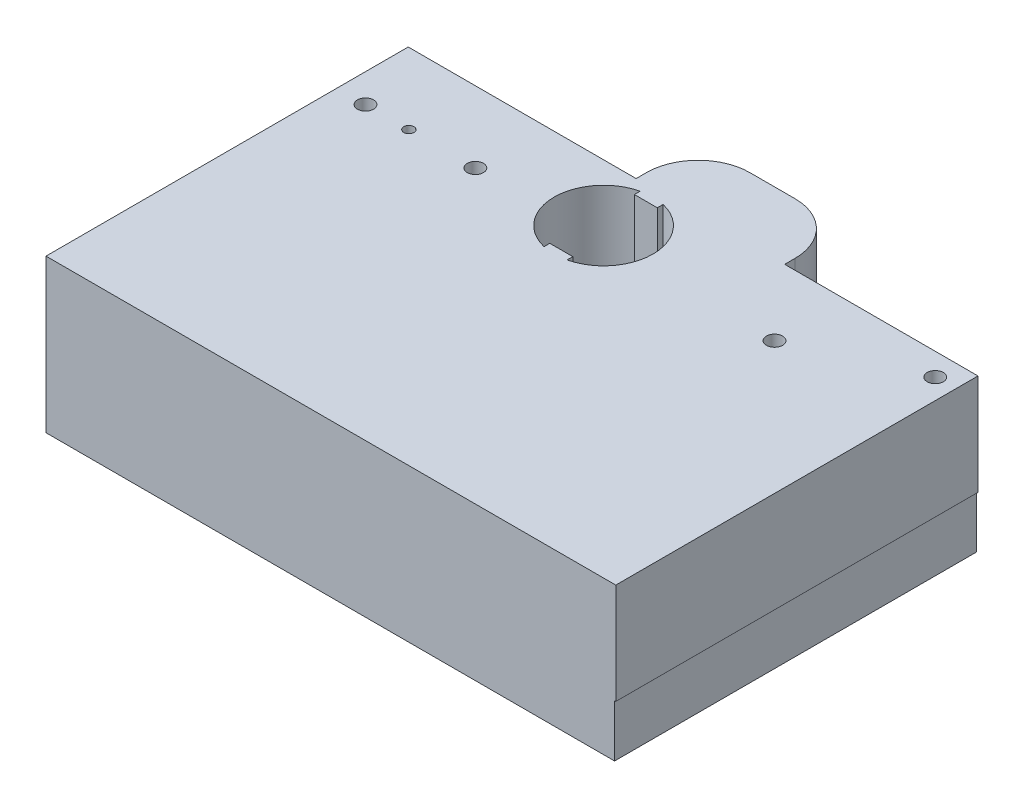
ISO-10303-21;
HEADER;
FILE_DESCRIPTION(('STEP AP214'),'2;1');
FILE_NAME('part.step','',(''),(''),'','','');
FILE_SCHEMA(('AUTOMOTIVE_DESIGN { 1 0 10303 214 1 1 1 1 }'));
ENDSEC;
DATA;
#1=APPLICATION_CONTEXT('core data for automotive mechanical design processes');
#2=APPLICATION_PROTOCOL_DEFINITION('international standard','automotive_design',2000,#1);
#3=PRODUCT_CONTEXT('',#1,'mechanical');
#4=PRODUCT('Part','Part','',(#3));
#5=PRODUCT_RELATED_PRODUCT_CATEGORY('part','',(#4));
#6=PRODUCT_DEFINITION_FORMATION('','',#4);
#7=PRODUCT_DEFINITION_CONTEXT('part definition',#1,'design');
#8=PRODUCT_DEFINITION('design','',#6,#7);
#9=PRODUCT_DEFINITION_SHAPE('','',#8);
#10=(LENGTH_UNIT() NAMED_UNIT(*) SI_UNIT(.MILLI.,.METRE.));
#11=(NAMED_UNIT(*) PLANE_ANGLE_UNIT() SI_UNIT($,.RADIAN.));
#12=(NAMED_UNIT(*) SI_UNIT($,.STERADIAN.) SOLID_ANGLE_UNIT());
#13=UNCERTAINTY_MEASURE_WITH_UNIT(LENGTH_MEASURE(1.E-05),#10,'distance_accuracy_value','');
#14=(GEOMETRIC_REPRESENTATION_CONTEXT(3) GLOBAL_UNCERTAINTY_ASSIGNED_CONTEXT((#13)) GLOBAL_UNIT_ASSIGNED_CONTEXT((#10,
#11,#12)) REPRESENTATION_CONTEXT('',''));
#15=CARTESIAN_POINT('',(0.,0.,0.));
#16=DIRECTION('',(0.,0.,1.));
#17=DIRECTION('',(1.,0.,0.));
#18=AXIS2_PLACEMENT_3D('',#15,#16,#17);
#19=CARTESIAN_POINT('',(0.,75.184,-178.));
#20=DIRECTION('',(0.,0.,1.));
#21=DIRECTION('',(1.,0.,0.));
#22=AXIS2_PLACEMENT_3D('',#19,#20,#21);
#23=PLANE('',#22);
#24=DIRECTION('',(0.,-1.,0.));
#25=VECTOR('',#24,1.);
#26=CARTESIAN_POINT('',(185.000000008,75.184,-178.));
#27=LINE('',#26,#25);
#28=CARTESIAN_POINT('',(185.000000008,75.184,-178.));
#29=VERTEX_POINT('',#28);
#30=CARTESIAN_POINT('',(185.000000008,25.654,-178.));
#31=VERTEX_POINT('',#30);
#32=EDGE_CURVE('E204',#29,#31,#27,.T.);
#33=ORIENTED_EDGE('',*,*,#32,.F.);
#34=DIRECTION('',(-1.,0.,0.));
#35=VECTOR('',#34,1.);
#36=CARTESIAN_POINT('',(0.,75.184,-178.));
#37=LINE('',#36,#35);
#38=CARTESIAN_POINT('',(280.,75.184,-178.));
#39=VERTEX_POINT('',#38);
#40=EDGE_CURVE('E211',#39,#29,#37,.T.);
#41=ORIENTED_EDGE('',*,*,#40,.F.);
#42=DIRECTION('',(0.,-1.,0.));
#43=VECTOR('',#42,1.);
#44=CARTESIAN_POINT('',(280.,75.184,-178.));
#45=LINE('',#44,#43);
#46=CARTESIAN_POINT('',(280.,25.654,-178.));
#47=VERTEX_POINT('',#46);
#48=EDGE_CURVE('E307',#39,#47,#45,.T.);
#49=ORIENTED_EDGE('',*,*,#48,.T.);
#50=DIRECTION('',(-1.,0.,0.));
#51=VECTOR('',#50,1.);
#52=CARTESIAN_POINT('',(0.,25.654,-178.));
#53=LINE('',#52,#51);
#54=EDGE_CURVE('E311',#47,#31,#53,.T.);
#55=ORIENTED_EDGE('',*,*,#54,.T.);
#56=EDGE_LOOP('',(#33,#41,#49,#55));
#57=FACE_BOUND('',#56,.T.);
#58=ADVANCED_FACE('F40',(#57),#23,.F.);
#59=CARTESIAN_POINT('',(0.,25.654,0.));
#60=DIRECTION('',(1.,0.,0.));
#61=DIRECTION('',(0.,0.,-1.));
#62=AXIS2_PLACEMENT_3D('',#59,#60,#61);
#63=PLANE('',#62);
#64=DIRECTION('',(0.,-1.,0.));
#65=VECTOR('',#64,1.);
#66=CARTESIAN_POINT('',(0.,25.654,0.));
#67=LINE('',#66,#65);
#68=CARTESIAN_POINT('',(0.,75.184,0.));
#69=VERTEX_POINT('',#68);
#70=CARTESIAN_POINT('',(0.,0.,0.));
#71=VERTEX_POINT('',#70);
#72=EDGE_CURVE('E274',#69,#71,#67,.T.);
#73=ORIENTED_EDGE('',*,*,#72,.F.);
#74=DIRECTION('',(0.,0.,1.));
#75=VECTOR('',#74,1.);
#76=CARTESIAN_POINT('',(0.,75.184,-108.000000046));
#77=LINE('',#76,#75);
#78=CARTESIAN_POINT('',(0.,75.184,-178.));
#79=VERTEX_POINT('',#78);
#80=EDGE_CURVE('E313',#79,#69,#77,.T.);
#81=ORIENTED_EDGE('',*,*,#80,.F.);
#82=DIRECTION('',(0.,-1.,0.));
#83=VECTOR('',#82,1.);
#84=CARTESIAN_POINT('',(0.,75.184,-178.));
#85=LINE('',#84,#83);
#86=CARTESIAN_POINT('',(0.,25.654,-178.));
#87=VERTEX_POINT('',#86);
#88=EDGE_CURVE('E208',#79,#87,#85,.T.);
#89=ORIENTED_EDGE('',*,*,#88,.T.);
#90=DIRECTION('',(0.,0.,1.));
#91=VECTOR('',#90,1.);
#92=CARTESIAN_POINT('',(0.,25.654,-108.000000046));
#93=LINE('',#92,#91);
#94=CARTESIAN_POINT('',(0.,25.654,-177.8));
#95=VERTEX_POINT('',#94);
#96=EDGE_CURVE('E224',#87,#95,#93,.T.);
#97=ORIENTED_EDGE('',*,*,#96,.T.);
#98=DIRECTION('',(0.,-1.,0.));
#99=VECTOR('',#98,1.);
#100=CARTESIAN_POINT('',(0.,25.654,-177.8));
#101=LINE('',#100,#99);
#102=CARTESIAN_POINT('',(0.,0.,-177.8));
#103=VERTEX_POINT('',#102);
#104=EDGE_CURVE('E288',#95,#103,#101,.T.);
#105=ORIENTED_EDGE('',*,*,#104,.T.);
#106=DIRECTION('',(0.,0.,1.));
#107=VECTOR('',#106,1.);
#108=CARTESIAN_POINT('',(0.,0.,0.));
#109=LINE('',#108,#107);
#110=EDGE_CURVE('E278',#103,#71,#109,.T.);
#111=ORIENTED_EDGE('',*,*,#110,.T.);
#112=EDGE_LOOP('',(#73,#81,#89,#97,#105,#111));
#113=FACE_BOUND('',#112,.T.);
#114=ADVANCED_FACE('F364',(#113),#63,.F.);
#115=CARTESIAN_POINT('',(0.,25.654,0.));
#116=DIRECTION('',(0.,0.,-1.));
#117=DIRECTION('',(-1.,0.,0.));
#118=AXIS2_PLACEMENT_3D('',#115,#116,#117);
#119=PLANE('',#118);
#120=DIRECTION('',(1.,0.,0.));
#121=VECTOR('',#120,1.);
#122=CARTESIAN_POINT('',(0.,0.,0.));
#123=LINE('',#122,#121);
#124=CARTESIAN_POINT('',(279.4,0.,0.));
#125=VERTEX_POINT('',#124);
#126=EDGE_CURVE('E297',#71,#125,#123,.T.);
#127=ORIENTED_EDGE('',*,*,#126,.T.);
#128=DIRECTION('',(0.,-1.,0.));
#129=VECTOR('',#128,1.);
#130=CARTESIAN_POINT('',(279.4,25.654,0.));
#131=LINE('',#130,#129);
#132=CARTESIAN_POINT('',(279.4,25.654,0.));
#133=VERTEX_POINT('',#132);
#134=EDGE_CURVE('E282',#133,#125,#131,.T.);
#135=ORIENTED_EDGE('',*,*,#134,.F.);
#136=DIRECTION('',(1.,0.,0.));
#137=VECTOR('',#136,1.);
#138=CARTESIAN_POINT('',(127.6,25.654,0.));
#139=LINE('',#138,#137);
#140=CARTESIAN_POINT('',(280.,25.654,0.));
#141=VERTEX_POINT('',#140);
#142=EDGE_CURVE('E316',#133,#141,#139,.T.);
#143=ORIENTED_EDGE('',*,*,#142,.T.);
#144=DIRECTION('',(0.,-1.,0.));
#145=VECTOR('',#144,1.);
#146=CARTESIAN_POINT('',(280.,75.184,0.));
#147=LINE('',#146,#145);
#148=CARTESIAN_POINT('',(280.,75.184,0.));
#149=VERTEX_POINT('',#148);
#150=EDGE_CURVE('E279',#149,#141,#147,.T.);
#151=ORIENTED_EDGE('',*,*,#150,.F.);
#152=DIRECTION('',(1.,0.,0.));
#153=VECTOR('',#152,1.);
#154=CARTESIAN_POINT('',(127.6,75.184,0.));
#155=LINE('',#154,#153);
#156=EDGE_CURVE('E218',#69,#149,#155,.T.);
#157=ORIENTED_EDGE('',*,*,#156,.F.);
#158=ORIENTED_EDGE('',*,*,#72,.T.);
#159=EDGE_LOOP('',(#127,#135,#143,#151,#157,#158));
#160=FACE_BOUND('',#159,.T.);
#161=ADVANCED_FACE('F340',(#160),#119,.F.);
#162=CARTESIAN_POINT('',(279.4,25.654,0.));
#163=DIRECTION('',(-1.,0.,0.));
#164=DIRECTION('',(0.,0.,1.));
#165=AXIS2_PLACEMENT_3D('',#162,#163,#164);
#166=PLANE('',#165);
#167=DIRECTION('',(0.,0.,-1.));
#168=VECTOR('',#167,1.);
#169=CARTESIAN_POINT('',(279.4,0.,0.));
#170=LINE('',#169,#168);
#171=CARTESIAN_POINT('',(279.4,0.,-177.8));
#172=VERTEX_POINT('',#171);
#173=EDGE_CURVE('E295',#125,#172,#170,.T.);
#174=ORIENTED_EDGE('',*,*,#173,.T.);
#175=DIRECTION('',(0.,-1.,0.));
#176=VECTOR('',#175,1.);
#177=CARTESIAN_POINT('',(279.4,25.654,-177.8));
#178=LINE('',#177,#176);
#179=CARTESIAN_POINT('',(279.4,25.654,-177.8));
#180=VERTEX_POINT('',#179);
#181=EDGE_CURVE('E285',#180,#172,#178,.T.);
#182=ORIENTED_EDGE('',*,*,#181,.F.);
#183=DIRECTION('',(0.,0.,-1.));
#184=VECTOR('',#183,1.);
#185=CARTESIAN_POINT('',(279.4,25.654,0.));
#186=LINE('',#185,#184);
#187=EDGE_CURVE('E294',#133,#180,#186,.T.);
#188=ORIENTED_EDGE('',*,*,#187,.F.);
#189=ORIENTED_EDGE('',*,*,#134,.T.);
#190=EDGE_LOOP('',(#174,#182,#188,#189));
#191=FACE_BOUND('',#190,.T.);
#192=ADVANCED_FACE('F401',(#191),#166,.F.);
#193=CARTESIAN_POINT('',(0.,25.654,-177.8));
#194=DIRECTION('',(0.,0.,1.));
#195=DIRECTION('',(1.,0.,0.));
#196=AXIS2_PLACEMENT_3D('',#193,#194,#195);
#197=PLANE('',#196);
#198=DIRECTION('',(-1.,0.,0.));
#199=VECTOR('',#198,1.);
#200=CARTESIAN_POINT('',(0.,0.,-177.8));
#201=LINE('',#200,#199);
#202=EDGE_CURVE('E292',#172,#103,#201,.T.);
#203=ORIENTED_EDGE('',*,*,#202,.T.);
#204=ORIENTED_EDGE('',*,*,#104,.F.);
#205=DIRECTION('',(-1.,0.,0.));
#206=VECTOR('',#205,1.);
#207=CARTESIAN_POINT('',(0.,25.654,-177.8));
#208=LINE('',#207,#206);
#209=EDGE_CURVE('E291',#180,#95,#208,.T.);
#210=ORIENTED_EDGE('',*,*,#209,.F.);
#211=ORIENTED_EDGE('',*,*,#181,.T.);
#212=EDGE_LOOP('',(#203,#204,#210,#211));
#213=FACE_BOUND('',#212,.T.);
#214=ADVANCED_FACE('F397',(#213),#197,.F.);
#215=CARTESIAN_POINT('',(0.,0.,0.));
#216=DIRECTION('',(0.,-1.,0.));
#217=DIRECTION('',(0.,0.,-1.));
#218=AXIS2_PLACEMENT_3D('',#215,#216,#217);
#219=PLANE('',#218);
#220=CARTESIAN_POINT('',(215.,0.,-143.));
#221=DIRECTION('',(0.,-1.,0.));
#222=DIRECTION('',(0.,0.,-1.));
#223=AXIS2_PLACEMENT_3D('',#220,#221,#222);
#224=CIRCLE('',#223,3.96874999999999);
#225=CARTESIAN_POINT('',(215.,0.,-146.96875));
#226=VERTEX_POINT('',#225);
#227=EDGE_CURVE('E275',#226,#226,#224,.T.);
#228=ORIENTED_EDGE('',*,*,#227,.F.);
#229=EDGE_LOOP('',(#228));
#230=FACE_BOUND('',#229,.T.);
#231=ORIENTED_EDGE('',*,*,#110,.F.);
#232=ORIENTED_EDGE('',*,*,#202,.F.);
#233=ORIENTED_EDGE('',*,*,#173,.F.);
#234=ORIENTED_EDGE('',*,*,#126,.F.);
#235=EDGE_LOOP('',(#231,#232,#233,#234));
#236=FACE_BOUND('',#235,.T.);
#237=ADVANCED_FACE('F388',(#230,#236),#219,.T.);
#238=CARTESIAN_POINT('',(215.,-12.446,-143.));
#239=DIRECTION('',(0.,1.,0.));
#240=DIRECTION('',(0.,0.,1.));
#241=AXIS2_PLACEMENT_3D('',#238,#239,#240);
#242=CYLINDRICAL_SURFACE('',#241,3.96874999999999);
#243=ORIENTED_EDGE('',*,*,#227,.T.);
#244=EDGE_LOOP('',(#243));
#245=FACE_BOUND('',#244,.T.);
#246=CARTESIAN_POINT('',(215.,75.184,-143.));
#247=DIRECTION('',(0.,1.,0.));
#248=DIRECTION('',(0.,0.,1.));
#249=AXIS2_PLACEMENT_3D('',#246,#247,#248);
#250=CIRCLE('',#249,3.96874999999999);
#251=CARTESIAN_POINT('',(215.,75.184,-139.03125));
#252=VERTEX_POINT('',#251);
#253=EDGE_CURVE('E781',#252,#252,#250,.T.);
#254=ORIENTED_EDGE('',*,*,#253,.T.);
#255=EDGE_LOOP('',(#254));
#256=FACE_BOUND('',#255,.T.);
#257=ADVANCED_FACE('F386',(#245,#256),#242,.F.);
#258=CARTESIAN_POINT('',(0.,75.184,0.));
#259=DIRECTION('',(0.,-1.,0.));
#260=DIRECTION('',(0.,0.,-1.));
#261=AXIS2_PLACEMENT_3D('',#258,#259,#260);
#262=PLANE('',#261);
#263=DIRECTION('',(-1.,0.,0.));
#264=VECTOR('',#263,1.);
#265=CARTESIAN_POINT('',(185.000000008,75.184,-208.48));
#266=LINE('',#265,#264);
#267=CARTESIAN_POINT('',(159.600000008,75.184,-208.48));
#268=VERTEX_POINT('',#267);
#269=CARTESIAN_POINT('',(137.400000008,75.184,-208.48));
#270=VERTEX_POINT('',#269);
#271=EDGE_CURVE('E247',#268,#270,#266,.T.);
#272=ORIENTED_EDGE('',*,*,#271,.T.);
#273=CARTESIAN_POINT('',(137.400000008,75.184,-183.08));
#274=DIRECTION('',(0.,-1.,0.));
#275=DIRECTION('',(0.,0.,-1.));
#276=AXIS2_PLACEMENT_3D('',#273,#274,#275);
#277=CIRCLE('',#276,25.4);
#278=CARTESIAN_POINT('',(112.000000008,75.184,-183.08));
#279=VERTEX_POINT('',#278);
#280=EDGE_CURVE('E12',#270,#279,#277,.F.);
#281=ORIENTED_EDGE('',*,*,#280,.T.);
#282=DIRECTION('',(0.,0.,1.));
#283=VECTOR('',#282,1.);
#284=CARTESIAN_POINT('',(112.000000008,75.184,-208.48));
#285=LINE('',#284,#283);
#286=CARTESIAN_POINT('',(112.000000008,75.184,-178.));
#287=VERTEX_POINT('',#286);
#288=EDGE_CURVE('E183',#279,#287,#285,.T.);
#289=ORIENTED_EDGE('',*,*,#288,.T.);
#290=EDGE_CURVE('E189',#287,#79,#37,.T.);
#291=ORIENTED_EDGE('',*,*,#290,.T.);
#292=ORIENTED_EDGE('',*,*,#80,.T.);
#293=ORIENTED_EDGE('',*,*,#156,.T.);
#294=DIRECTION('',(0.,0.,-1.));
#295=VECTOR('',#294,1.);
#296=CARTESIAN_POINT('',(280.,75.184,0.));
#297=LINE('',#296,#295);
#298=EDGE_CURVE('E212',#149,#39,#297,.T.);
#299=ORIENTED_EDGE('',*,*,#298,.T.);
#300=ORIENTED_EDGE('',*,*,#40,.T.);
#301=DIRECTION('',(0.,0.,1.));
#302=VECTOR('',#301,1.);
#303=CARTESIAN_POINT('',(185.000000008,75.184,-208.48));
#304=LINE('',#303,#302);
#305=CARTESIAN_POINT('',(185.000000008,75.184,-183.08));
#306=VERTEX_POINT('',#305);
#307=EDGE_CURVE('E197',#306,#29,#304,.T.);
#308=ORIENTED_EDGE('',*,*,#307,.F.);
#309=CARTESIAN_POINT('',(159.600000008,75.184,-183.08));
#310=DIRECTION('',(0.,-1.,0.));
#311=DIRECTION('',(0.,0.,-1.));
#312=AXIS2_PLACEMENT_3D('',#309,#310,#311);
#313=CIRCLE('',#312,25.4);
#314=EDGE_CURVE('E266',#306,#268,#313,.F.);
#315=ORIENTED_EDGE('',*,*,#314,.T.);
#316=EDGE_LOOP('',(#272,#281,#289,#291,#292,#293,#299,#300,#308,#315));
#317=FACE_BOUND('',#316,.T.);
#318=DIRECTION('',(1.,0.,0.));
#319=VECTOR('',#318,1.);
#320=CARTESIAN_POINT('',(118.360720333,75.184,-129.22));
#321=LINE('',#320,#319);
#322=CARTESIAN_POINT('',(118.360720333,75.184,-129.22));
#323=VERTEX_POINT('',#322);
#324=CARTESIAN_POINT('',(129.639279667044,75.184,-129.22));
#325=VERTEX_POINT('',#324);
#326=EDGE_CURVE('E706',#323,#325,#321,.T.);
#327=ORIENTED_EDGE('',*,*,#326,.F.);
#328=DIRECTION('',(0.,0.,-1.));
#329=VECTOR('',#328,1.);
#330=CARTESIAN_POINT('',(118.360720333,75.184,-129.22));
#331=LINE('',#330,#329);
#332=CARTESIAN_POINT('',(118.360720333,75.184,-126.383968901678));
#333=VERTEX_POINT('',#332);
#334=EDGE_CURVE('E711',#333,#323,#331,.T.);
#335=ORIENTED_EDGE('',*,*,#334,.F.);
#336=CARTESIAN_POINT('',(124.000000000022,75.184,-149.999999999989));
#337=DIRECTION('',(0.,1.,0.));
#338=DIRECTION('',(0.,0.,1.));
#339=AXIS2_PLACEMENT_3D('',#336,#337,#338);
#340=CIRCLE('',#339,24.2799999999848);
#341=CARTESIAN_POINT('',(118.360720333,75.184,-173.616031098299));
#342=VERTEX_POINT('',#341);
#343=EDGE_CURVE('E731',#342,#333,#340,.T.);
#344=ORIENTED_EDGE('',*,*,#343,.F.);
#345=DIRECTION('',(0.,0.,-1.));
#346=VECTOR('',#345,1.);
#347=CARTESIAN_POINT('',(118.360720333,75.184,-173.616031098299));
#348=LINE('',#347,#346);
#349=CARTESIAN_POINT('',(118.360720333,75.184,-170.779999999977));
#350=VERTEX_POINT('',#349);
#351=EDGE_CURVE('E797',#350,#342,#348,.T.);
#352=ORIENTED_EDGE('',*,*,#351,.F.);
#353=DIRECTION('',(-1.,0.,0.));
#354=VECTOR('',#353,1.);
#355=CARTESIAN_POINT('',(118.360720333,75.184,-170.779999999977));
#356=LINE('',#355,#354);
#357=CARTESIAN_POINT('',(129.639279667043,75.184,-170.779999999977));
#358=VERTEX_POINT('',#357);
#359=EDGE_CURVE('E795',#358,#350,#356,.T.);
#360=ORIENTED_EDGE('',*,*,#359,.F.);
#361=DIRECTION('',(-1.27227971236532E-13,0.,1.));
#362=VECTOR('',#361,1.);
#363=CARTESIAN_POINT('',(129.639279667044,75.184,-173.616031098299));
#364=LINE('',#363,#362);
#365=CARTESIAN_POINT('',(129.639279667044,75.184,-173.616031098299));
#366=VERTEX_POINT('',#365);
#367=EDGE_CURVE('E793',#366,#358,#364,.T.);
#368=ORIENTED_EDGE('',*,*,#367,.F.);
#369=CARTESIAN_POINT('',(124.000000000022,75.184,-149.999999999989));
#370=DIRECTION('',(0.,1.,0.));
#371=DIRECTION('',(0.,0.,1.));
#372=AXIS2_PLACEMENT_3D('',#369,#370,#371);
#373=CIRCLE('',#372,24.2799999999847);
#374=CARTESIAN_POINT('',(129.639279667044,75.184,-126.383968901678));
#375=VERTEX_POINT('',#374);
#376=EDGE_CURVE('E722',#375,#366,#373,.T.);
#377=ORIENTED_EDGE('',*,*,#376,.F.);
#378=DIRECTION('',(0.,0.,1.));
#379=VECTOR('',#378,1.);
#380=CARTESIAN_POINT('',(129.639279667044,75.184,-129.22));
#381=LINE('',#380,#379);
#382=EDGE_CURVE('E736',#325,#375,#381,.T.);
#383=ORIENTED_EDGE('',*,*,#382,.F.);
#384=EDGE_LOOP('',(#327,#335,#344,#352,#360,#368,#377,#383));
#385=FACE_BOUND('',#384,.T.);
#386=CARTESIAN_POINT('',(35.3189243971,75.184,-143.));
#387=DIRECTION('',(0.,1.,0.));
#388=DIRECTION('',(0.,0.,1.));
#389=AXIS2_PLACEMENT_3D('',#386,#387,#388);
#390=CIRCLE('',#389,2.5);
#391=CARTESIAN_POINT('',(35.3189243971,75.184,-140.5));
#392=VERTEX_POINT('',#391);
#393=EDGE_CURVE('E688',#392,#392,#390,.T.);
#394=ORIENTED_EDGE('',*,*,#393,.F.);
#395=EDGE_LOOP('',(#394));
#396=FACE_BOUND('',#395,.T.);
#397=CARTESIAN_POINT('',(14.,75.184,-143.));
#398=DIRECTION('',(0.,1.,0.));
#399=DIRECTION('',(0.,0.,1.));
#400=AXIS2_PLACEMENT_3D('',#397,#398,#399);
#401=CIRCLE('',#400,3.96875);
#402=CARTESIAN_POINT('',(14.,75.184,-139.03125));
#403=VERTEX_POINT('',#402);
#404=EDGE_CURVE('E762',#403,#403,#401,.T.);
#405=ORIENTED_EDGE('',*,*,#404,.F.);
#406=EDGE_LOOP('',(#405));
#407=FACE_BOUND('',#406,.T.);
#408=CARTESIAN_POINT('',(68.,75.184,-143.));
#409=DIRECTION('',(0.,1.,0.));
#410=DIRECTION('',(0.,0.,1.));
#411=AXIS2_PLACEMENT_3D('',#408,#409,#410);
#412=CIRCLE('',#411,3.96875000000001);
#413=CARTESIAN_POINT('',(68.,75.184,-139.03125));
#414=VERTEX_POINT('',#413);
#415=EDGE_CURVE('E763',#414,#414,#412,.T.);
#416=ORIENTED_EDGE('',*,*,#415,.F.);
#417=EDGE_LOOP('',(#416));
#418=FACE_BOUND('',#417,.T.);
#419=CARTESIAN_POINT('',(270.,75.184,-167.));
#420=DIRECTION('',(0.,1.,0.));
#421=DIRECTION('',(0.,0.,1.));
#422=AXIS2_PLACEMENT_3D('',#419,#420,#421);
#423=CIRCLE('',#422,3.96875000000008);
#424=CARTESIAN_POINT('',(270.,75.184,-163.03125));
#425=VERTEX_POINT('',#424);
#426=EDGE_CURVE('E771',#425,#425,#423,.T.);
#427=ORIENTED_EDGE('',*,*,#426,.F.);
#428=EDGE_LOOP('',(#427));
#429=FACE_BOUND('',#428,.T.);
#430=ORIENTED_EDGE('',*,*,#253,.F.);
#431=EDGE_LOOP('',(#430));
#432=FACE_BOUND('',#431,.T.);
#433=ADVANCED_FACE('F185',(#317,#385,#396,#407,#418,#429,#432),#262,.F.);
#434=CARTESIAN_POINT('',(0.,25.654,0.));
#435=DIRECTION('',(0.,-1.,0.));
#436=DIRECTION('',(0.,0.,-1.));
#437=AXIS2_PLACEMENT_3D('',#434,#435,#436);
#438=PLANE('',#437);
#439=DIRECTION('',(0.,0.,1.));
#440=VECTOR('',#439,1.);
#441=CARTESIAN_POINT('',(112.000000008,25.654,-208.48));
#442=LINE('',#441,#440);
#443=CARTESIAN_POINT('',(112.000000008,25.654,-183.08));
#444=VERTEX_POINT('',#443);
#445=CARTESIAN_POINT('',(112.000000008,25.654,-178.));
#446=VERTEX_POINT('',#445);
#447=EDGE_CURVE('E196',#444,#446,#442,.T.);
#448=ORIENTED_EDGE('',*,*,#447,.F.);
#449=CARTESIAN_POINT('',(137.400000008,25.654,-183.08));
#450=DIRECTION('',(0.,-1.,0.));
#451=DIRECTION('',(0.,0.,-1.));
#452=AXIS2_PLACEMENT_3D('',#449,#450,#451);
#453=CIRCLE('',#452,25.4);
#454=CARTESIAN_POINT('',(137.400000008,25.654,-208.48));
#455=VERTEX_POINT('',#454);
#456=EDGE_CURVE('E63',#444,#455,#453,.T.);
#457=ORIENTED_EDGE('',*,*,#456,.T.);
#458=DIRECTION('',(-1.,0.,0.));
#459=VECTOR('',#458,1.);
#460=CARTESIAN_POINT('',(185.000000008,25.654,-208.48));
#461=LINE('',#460,#459);
#462=CARTESIAN_POINT('',(159.600000008,25.654,-208.48));
#463=VERTEX_POINT('',#462);
#464=EDGE_CURVE('E251',#463,#455,#461,.T.);
#465=ORIENTED_EDGE('',*,*,#464,.F.);
#466=CARTESIAN_POINT('',(159.600000008,25.654,-183.08));
#467=DIRECTION('',(0.,-1.,0.));
#468=DIRECTION('',(0.,0.,-1.));
#469=AXIS2_PLACEMENT_3D('',#466,#467,#468);
#470=CIRCLE('',#469,25.4);
#471=CARTESIAN_POINT('',(185.000000008,25.654,-183.08));
#472=VERTEX_POINT('',#471);
#473=EDGE_CURVE('E271',#463,#472,#470,.T.);
#474=ORIENTED_EDGE('',*,*,#473,.T.);
#475=DIRECTION('',(0.,0.,1.));
#476=VECTOR('',#475,1.);
#477=CARTESIAN_POINT('',(185.000000008,25.654,-208.48));
#478=LINE('',#477,#476);
#479=EDGE_CURVE('E241',#472,#31,#478,.T.);
#480=ORIENTED_EDGE('',*,*,#479,.T.);
#481=ORIENTED_EDGE('',*,*,#54,.F.);
#482=DIRECTION('',(0.,0.,-1.));
#483=VECTOR('',#482,1.);
#484=CARTESIAN_POINT('',(280.,25.654,0.));
#485=LINE('',#484,#483);
#486=EDGE_CURVE('E315',#141,#47,#485,.T.);
#487=ORIENTED_EDGE('',*,*,#486,.F.);
#488=ORIENTED_EDGE('',*,*,#142,.F.);
#489=ORIENTED_EDGE('',*,*,#187,.T.);
#490=ORIENTED_EDGE('',*,*,#209,.T.);
#491=ORIENTED_EDGE('',*,*,#96,.F.);
#492=EDGE_CURVE('E314',#446,#87,#53,.T.);
#493=ORIENTED_EDGE('',*,*,#492,.F.);
#494=EDGE_LOOP('',(#448,#457,#465,#474,#480,#481,#487,#488,#489,#490,#491,#493));
#495=FACE_BOUND('',#494,.T.);
#496=ADVANCED_FACE('F352',(#495),#438,.T.);
#497=CARTESIAN_POINT('',(280.,75.184,0.));
#498=DIRECTION('',(-1.,0.,0.));
#499=DIRECTION('',(0.,0.,1.));
#500=AXIS2_PLACEMENT_3D('',#497,#498,#499);
#501=PLANE('',#500);
#502=ORIENTED_EDGE('',*,*,#486,.T.);
#503=ORIENTED_EDGE('',*,*,#48,.F.);
#504=ORIENTED_EDGE('',*,*,#298,.F.);
#505=ORIENTED_EDGE('',*,*,#150,.T.);
#506=EDGE_LOOP('',(#502,#503,#504,#505));
#507=FACE_BOUND('',#506,.T.);
#508=ADVANCED_FACE('F343',(#507),#501,.F.);
#509=ORIENTED_EDGE('',*,*,#290,.F.);
#510=DIRECTION('',(0.,-1.,0.));
#511=VECTOR('',#510,1.);
#512=CARTESIAN_POINT('',(112.000000008,75.184,-178.));
#513=LINE('',#512,#511);
#514=EDGE_CURVE('E200',#287,#446,#513,.T.);
#515=ORIENTED_EDGE('',*,*,#514,.T.);
#516=ORIENTED_EDGE('',*,*,#492,.T.);
#517=ORIENTED_EDGE('',*,*,#88,.F.);
#518=EDGE_LOOP('',(#509,#515,#516,#517));
#519=FACE_BOUND('',#518,.T.);
#520=ADVANCED_FACE('F206',(#519),#23,.F.);
#521=CARTESIAN_POINT('',(118.360720333,75.184,-129.22));
#522=DIRECTION('',(0.,0.,-1.));
#523=DIRECTION('',(-1.,0.,0.));
#524=AXIS2_PLACEMENT_3D('',#521,#522,#523);
#525=PLANE('',#524);
#526=DIRECTION('',(1.,0.,0.));
#527=VECTOR('',#526,1.);
#528=CARTESIAN_POINT('',(118.360720333,25.654,-129.22));
#529=LINE('',#528,#527);
#530=CARTESIAN_POINT('',(118.360720333,25.654,-129.22));
#531=VERTEX_POINT('',#530);
#532=CARTESIAN_POINT('',(129.639279667044,25.654,-129.22));
#533=VERTEX_POINT('',#532);
#534=EDGE_CURVE('E684',#531,#533,#529,.T.);
#535=ORIENTED_EDGE('',*,*,#534,.F.);
#536=DIRECTION('',(0.,-1.,0.));
#537=VECTOR('',#536,1.);
#538=CARTESIAN_POINT('',(118.360720333,75.184,-129.22));
#539=LINE('',#538,#537);
#540=EDGE_CURVE('E707',#323,#531,#539,.T.);
#541=ORIENTED_EDGE('',*,*,#540,.F.);
#542=ORIENTED_EDGE('',*,*,#326,.T.);
#543=DIRECTION('',(0.,-1.,0.));
#544=VECTOR('',#543,1.);
#545=CARTESIAN_POINT('',(129.639279667044,75.184,-129.22));
#546=LINE('',#545,#544);
#547=EDGE_CURVE('E321',#325,#533,#546,.T.);
#548=ORIENTED_EDGE('',*,*,#547,.T.);
#549=EDGE_LOOP('',(#535,#541,#542,#548));
#550=FACE_BOUND('',#549,.T.);
#551=ADVANCED_FACE('F374',(#550),#525,.T.);
#552=CARTESIAN_POINT('',(129.639279667044,75.184,-129.22));
#553=DIRECTION('',(1.,0.,0.));
#554=DIRECTION('',(0.,0.,-1.));
#555=AXIS2_PLACEMENT_3D('',#552,#553,#554);
#556=PLANE('',#555);
#557=DIRECTION('',(0.,0.,1.));
#558=VECTOR('',#557,1.);
#559=CARTESIAN_POINT('',(129.639279667044,25.654,-129.22));
#560=LINE('',#559,#558);
#561=CARTESIAN_POINT('',(129.639279667044,25.654,-126.383968901678));
#562=VERTEX_POINT('',#561);
#563=EDGE_CURVE('E678',#533,#562,#560,.T.);
#564=ORIENTED_EDGE('',*,*,#563,.F.);
#565=ORIENTED_EDGE('',*,*,#547,.F.);
#566=ORIENTED_EDGE('',*,*,#382,.T.);
#567=DIRECTION('',(0.,-1.,0.));
#568=VECTOR('',#567,1.);
#569=CARTESIAN_POINT('',(129.639279667044,75.184,-126.383968901678));
#570=LINE('',#569,#568);
#571=EDGE_CURVE('E325',#375,#562,#570,.T.);
#572=ORIENTED_EDGE('',*,*,#571,.T.);
#573=EDGE_LOOP('',(#564,#565,#566,#572));
#574=FACE_BOUND('',#573,.T.);
#575=ADVANCED_FACE('F378',(#574),#556,.T.);
#576=CARTESIAN_POINT('',(124.000000000022,75.184,-149.999999999989));
#577=DIRECTION('',(0.,-1.,0.));
#578=DIRECTION('',(0.,0.,-1.));
#579=AXIS2_PLACEMENT_3D('',#576,#577,#578);
#580=CYLINDRICAL_SURFACE('',#579,24.2799999999847);
#581=CARTESIAN_POINT('',(124.000000000022,25.654,-149.999999999989));
#582=DIRECTION('',(0.,1.,0.));
#583=DIRECTION('',(0.,0.,1.));
#584=AXIS2_PLACEMENT_3D('',#581,#582,#583);
#585=CIRCLE('',#584,24.2799999999847);
#586=CARTESIAN_POINT('',(129.639279667044,25.654,-173.616031098299));
#587=VERTEX_POINT('',#586);
#588=EDGE_CURVE('E683',#562,#587,#585,.T.);
#589=ORIENTED_EDGE('',*,*,#588,.F.);
#590=ORIENTED_EDGE('',*,*,#571,.F.);
#591=ORIENTED_EDGE('',*,*,#376,.T.);
#592=DIRECTION('',(0.,-1.,0.));
#593=VECTOR('',#592,1.);
#594=CARTESIAN_POINT('',(129.639279667044,75.184,-173.616031098299));
#595=LINE('',#594,#593);
#596=EDGE_CURVE('E330',#366,#587,#595,.T.);
#597=ORIENTED_EDGE('',*,*,#596,.T.);
#598=EDGE_LOOP('',(#589,#590,#591,#597));
#599=FACE_BOUND('',#598,.T.);
#600=ADVANCED_FACE('F563',(#599),#580,.F.);
#601=CARTESIAN_POINT('',(129.639279667044,75.184,-173.616031098299));
#602=DIRECTION('',(1.,0.,1.27227971236532E-13));
#603=DIRECTION('',(1.27227971236532E-13,0.,-1.));
#604=AXIS2_PLACEMENT_3D('',#601,#602,#603);
#605=PLANE('',#604);
#606=DIRECTION('',(-1.27227971236532E-13,0.,1.));
#607=VECTOR('',#606,1.);
#608=CARTESIAN_POINT('',(129.639279667044,25.654,-173.616031098299));
#609=LINE('',#608,#607);
#610=CARTESIAN_POINT('',(129.639279667043,25.654,-170.779999999977));
#611=VERTEX_POINT('',#610);
#612=EDGE_CURVE('E686',#587,#611,#609,.T.);
#613=ORIENTED_EDGE('',*,*,#612,.F.);
#614=ORIENTED_EDGE('',*,*,#596,.F.);
#615=ORIENTED_EDGE('',*,*,#367,.T.);
#616=DIRECTION('',(0.,-1.,0.));
#617=VECTOR('',#616,1.);
#618=CARTESIAN_POINT('',(129.639279667043,75.184,-170.779999999977));
#619=LINE('',#618,#617);
#620=EDGE_CURVE('E718',#358,#611,#619,.T.);
#621=ORIENTED_EDGE('',*,*,#620,.T.);
#622=EDGE_LOOP('',(#613,#614,#615,#621));
#623=FACE_BOUND('',#622,.T.);
#624=ADVANCED_FACE('F555',(#623),#605,.T.);
#625=CARTESIAN_POINT('',(118.360720333,75.184,-170.779999999977));
#626=DIRECTION('',(0.,0.,1.));
#627=DIRECTION('',(1.,0.,0.));
#628=AXIS2_PLACEMENT_3D('',#625,#626,#627);
#629=PLANE('',#628);
#630=DIRECTION('',(-1.,0.,0.));
#631=VECTOR('',#630,1.);
#632=CARTESIAN_POINT('',(118.360720333,25.654,-170.779999999977));
#633=LINE('',#632,#631);
#634=CARTESIAN_POINT('',(118.360720333,25.654,-170.779999999977));
#635=VERTEX_POINT('',#634);
#636=EDGE_CURVE('E694',#611,#635,#633,.T.);
#637=ORIENTED_EDGE('',*,*,#636,.F.);
#638=ORIENTED_EDGE('',*,*,#620,.F.);
#639=ORIENTED_EDGE('',*,*,#359,.T.);
#640=DIRECTION('',(0.,-1.,0.));
#641=VECTOR('',#640,1.);
#642=CARTESIAN_POINT('',(118.360720333,75.184,-170.779999999977));
#643=LINE('',#642,#641);
#644=EDGE_CURVE('E716',#350,#635,#643,.T.);
#645=ORIENTED_EDGE('',*,*,#644,.T.);
#646=EDGE_LOOP('',(#637,#638,#639,#645));
#647=FACE_BOUND('',#646,.T.);
#648=ADVANCED_FACE('F547',(#647),#629,.T.);
#649=CARTESIAN_POINT('',(118.360720333,75.184,-173.616031098299));
#650=DIRECTION('',(-1.,0.,0.));
#651=DIRECTION('',(0.,0.,1.));
#652=AXIS2_PLACEMENT_3D('',#649,#650,#651);
#653=PLANE('',#652);
#654=DIRECTION('',(0.,0.,-1.));
#655=VECTOR('',#654,1.);
#656=CARTESIAN_POINT('',(118.360720333,25.654,-173.616031098299));
#657=LINE('',#656,#655);
#658=CARTESIAN_POINT('',(118.360720333,25.654,-173.616031098299));
#659=VERTEX_POINT('',#658);
#660=EDGE_CURVE('E697',#635,#659,#657,.T.);
#661=ORIENTED_EDGE('',*,*,#660,.F.);
#662=ORIENTED_EDGE('',*,*,#644,.F.);
#663=ORIENTED_EDGE('',*,*,#351,.T.);
#664=DIRECTION('',(0.,-1.,0.));
#665=VECTOR('',#664,1.);
#666=CARTESIAN_POINT('',(118.360720333,75.184,-173.616031098299));
#667=LINE('',#666,#665);
#668=EDGE_CURVE('E714',#342,#659,#667,.T.);
#669=ORIENTED_EDGE('',*,*,#668,.T.);
#670=EDGE_LOOP('',(#661,#662,#663,#669));
#671=FACE_BOUND('',#670,.T.);
#672=ADVANCED_FACE('F539',(#671),#653,.T.);
#673=CARTESIAN_POINT('',(124.000000000022,75.184,-149.999999999989));
#674=DIRECTION('',(0.,-1.,0.));
#675=DIRECTION('',(0.,0.,-1.));
#676=AXIS2_PLACEMENT_3D('',#673,#674,#675);
#677=CYLINDRICAL_SURFACE('',#676,24.2799999999848);
#678=CARTESIAN_POINT('',(124.000000000022,25.654,-149.999999999989));
#679=DIRECTION('',(0.,1.,0.));
#680=DIRECTION('',(0.,0.,1.));
#681=AXIS2_PLACEMENT_3D('',#678,#679,#680);
#682=CIRCLE('',#681,24.2799999999848);
#683=CARTESIAN_POINT('',(118.360720333,25.654,-126.383968901678));
#684=VERTEX_POINT('',#683);
#685=EDGE_CURVE('E700',#659,#684,#682,.T.);
#686=ORIENTED_EDGE('',*,*,#685,.F.);
#687=ORIENTED_EDGE('',*,*,#668,.F.);
#688=ORIENTED_EDGE('',*,*,#343,.T.);
#689=DIRECTION('',(0.,-1.,0.));
#690=VECTOR('',#689,1.);
#691=CARTESIAN_POINT('',(118.360720333,75.184,-126.383968901678));
#692=LINE('',#691,#690);
#693=EDGE_CURVE('E710',#333,#684,#692,.T.);
#694=ORIENTED_EDGE('',*,*,#693,.T.);
#695=EDGE_LOOP('',(#686,#687,#688,#694));
#696=FACE_BOUND('',#695,.T.);
#697=ADVANCED_FACE('F531',(#696),#677,.F.);
#698=CARTESIAN_POINT('',(118.360720333,75.184,-129.22));
#699=DIRECTION('',(-1.,0.,0.));
#700=DIRECTION('',(0.,0.,1.));
#701=AXIS2_PLACEMENT_3D('',#698,#699,#700);
#702=PLANE('',#701);
#703=DIRECTION('',(0.,0.,-1.));
#704=VECTOR('',#703,1.);
#705=CARTESIAN_POINT('',(118.360720333,25.654,-129.22));
#706=LINE('',#705,#704);
#707=EDGE_CURVE('E703',#684,#531,#706,.T.);
#708=ORIENTED_EDGE('',*,*,#707,.F.);
#709=ORIENTED_EDGE('',*,*,#693,.F.);
#710=ORIENTED_EDGE('',*,*,#334,.T.);
#711=ORIENTED_EDGE('',*,*,#540,.T.);
#712=EDGE_LOOP('',(#708,#709,#710,#711));
#713=FACE_BOUND('',#712,.T.);
#714=ADVANCED_FACE('F523',(#713),#702,.T.);
#715=CARTESIAN_POINT('',(35.3189243971,75.184,-143.));
#716=DIRECTION('',(0.,-1.,0.));
#717=DIRECTION('',(0.,0.,-1.));
#718=AXIS2_PLACEMENT_3D('',#715,#716,#717);
#719=CYLINDRICAL_SURFACE('',#718,2.5);
#720=ORIENTED_EDGE('',*,*,#393,.T.);
#721=EDGE_LOOP('',(#720));
#722=FACE_BOUND('',#721,.T.);
#723=CARTESIAN_POINT('',(35.3189243971,25.654,-143.));
#724=DIRECTION('',(0.,1.,0.));
#725=DIRECTION('',(0.,0.,1.));
#726=AXIS2_PLACEMENT_3D('',#723,#724,#725);
#727=CIRCLE('',#726,2.5);
#728=CARTESIAN_POINT('',(35.3189243971,25.654,-140.5));
#729=VERTEX_POINT('',#728);
#730=EDGE_CURVE('E743',#729,#729,#727,.T.);
#731=ORIENTED_EDGE('',*,*,#730,.F.);
#732=EDGE_LOOP('',(#731));
#733=FACE_BOUND('',#732,.T.);
#734=ADVANCED_FACE('F515',(#722,#733),#719,.F.);
#735=CARTESIAN_POINT('',(14.,75.184,-143.));
#736=DIRECTION('',(0.,-1.,0.));
#737=DIRECTION('',(0.,0.,-1.));
#738=AXIS2_PLACEMENT_3D('',#735,#736,#737);
#739=CYLINDRICAL_SURFACE('',#738,3.96875);
#740=ORIENTED_EDGE('',*,*,#404,.T.);
#741=EDGE_LOOP('',(#740));
#742=FACE_BOUND('',#741,.T.);
#743=CARTESIAN_POINT('',(14.,25.654,-143.));
#744=DIRECTION('',(0.,1.,0.));
#745=DIRECTION('',(0.,0.,1.));
#746=AXIS2_PLACEMENT_3D('',#743,#744,#745);
#747=CIRCLE('',#746,3.96875);
#748=CARTESIAN_POINT('',(14.,25.654,-139.03125));
#749=VERTEX_POINT('',#748);
#750=EDGE_CURVE('E760',#749,#749,#747,.T.);
#751=ORIENTED_EDGE('',*,*,#750,.F.);
#752=EDGE_LOOP('',(#751));
#753=FACE_BOUND('',#752,.T.);
#754=ADVANCED_FACE('F507',(#742,#753),#739,.F.);
#755=CARTESIAN_POINT('',(68.,75.184,-143.));
#756=DIRECTION('',(0.,-1.,0.));
#757=DIRECTION('',(0.,0.,-1.));
#758=AXIS2_PLACEMENT_3D('',#755,#756,#757);
#759=CYLINDRICAL_SURFACE('',#758,3.96875000000001);
#760=ORIENTED_EDGE('',*,*,#415,.T.);
#761=EDGE_LOOP('',(#760));
#762=FACE_BOUND('',#761,.T.);
#763=CARTESIAN_POINT('',(68.,25.654,-143.));
#764=DIRECTION('',(0.,1.,0.));
#765=DIRECTION('',(0.,0.,1.));
#766=AXIS2_PLACEMENT_3D('',#763,#764,#765);
#767=CIRCLE('',#766,3.96875000000001);
#768=CARTESIAN_POINT('',(68.,25.654,-139.03125));
#769=VERTEX_POINT('',#768);
#770=EDGE_CURVE('E768',#769,#769,#767,.T.);
#771=ORIENTED_EDGE('',*,*,#770,.F.);
#772=EDGE_LOOP('',(#771));
#773=FACE_BOUND('',#772,.T.);
#774=ADVANCED_FACE('F499',(#762,#773),#759,.F.);
#775=CARTESIAN_POINT('',(270.,75.184,-167.));
#776=DIRECTION('',(0.,-1.,0.));
#777=DIRECTION('',(0.,0.,-1.));
#778=AXIS2_PLACEMENT_3D('',#775,#776,#777);
#779=CYLINDRICAL_SURFACE('',#778,3.96875000000008);
#780=ORIENTED_EDGE('',*,*,#426,.T.);
#781=EDGE_LOOP('',(#780));
#782=FACE_BOUND('',#781,.T.);
#783=CARTESIAN_POINT('',(270.,25.654,-167.));
#784=DIRECTION('',(0.,1.,0.));
#785=DIRECTION('',(0.,0.,1.));
#786=AXIS2_PLACEMENT_3D('',#783,#784,#785);
#787=CIRCLE('',#786,3.96875000000008);
#788=CARTESIAN_POINT('',(270.,25.654,-163.03125));
#789=VERTEX_POINT('',#788);
#790=EDGE_CURVE('E776',#789,#789,#787,.T.);
#791=ORIENTED_EDGE('',*,*,#790,.F.);
#792=EDGE_LOOP('',(#791));
#793=FACE_BOUND('',#792,.T.);
#794=ADVANCED_FACE('F492',(#782,#793),#779,.F.);
#795=CARTESIAN_POINT('',(0.,25.654,0.));
#796=DIRECTION('',(0.,-1.,0.));
#797=DIRECTION('',(0.,0.,-1.));
#798=AXIS2_PLACEMENT_3D('',#795,#796,#797);
#799=PLANE('',#798);
#800=ORIENTED_EDGE('',*,*,#730,.T.);
#801=EDGE_LOOP('',(#800));
#802=FACE_BOUND('',#801,.T.);
#803=ADVANCED_FACE('F468',(#802),#799,.F.);
#804=ORIENTED_EDGE('',*,*,#685,.T.);
#805=ORIENTED_EDGE('',*,*,#707,.T.);
#806=ORIENTED_EDGE('',*,*,#534,.T.);
#807=ORIENTED_EDGE('',*,*,#563,.T.);
#808=ORIENTED_EDGE('',*,*,#588,.T.);
#809=ORIENTED_EDGE('',*,*,#612,.T.);
#810=ORIENTED_EDGE('',*,*,#636,.T.);
#811=ORIENTED_EDGE('',*,*,#660,.T.);
#812=EDGE_LOOP('',(#804,#805,#806,#807,#808,#809,#810,#811));
#813=FACE_BOUND('',#812,.T.);
#814=ADVANCED_FACE('F479',(#813),#799,.F.);
#815=ORIENTED_EDGE('',*,*,#750,.T.);
#816=EDGE_LOOP('',(#815));
#817=FACE_BOUND('',#816,.T.);
#818=ADVANCED_FACE('F393',(#817),#799,.F.);
#819=ORIENTED_EDGE('',*,*,#790,.T.);
#820=EDGE_LOOP('',(#819));
#821=FACE_BOUND('',#820,.T.);
#822=ADVANCED_FACE('F390',(#821),#799,.F.);
#823=ORIENTED_EDGE('',*,*,#770,.T.);
#824=EDGE_LOOP('',(#823));
#825=FACE_BOUND('',#824,.T.);
#826=ADVANCED_FACE('F361',(#825),#799,.F.);
#827=CARTESIAN_POINT('',(112.000000008,75.184,-208.48));
#828=DIRECTION('',(-1.,0.,0.));
#829=DIRECTION('',(0.,-1.,0.));
#830=AXIS2_PLACEMENT_3D('',#827,#828,#829);
#831=PLANE('',#830);
#832=ORIENTED_EDGE('',*,*,#288,.F.);
#833=DIRECTION('',(0.,-1.,0.));
#834=VECTOR('',#833,1.);
#835=CARTESIAN_POINT('',(112.000000008,25.654,-183.08));
#836=LINE('',#835,#834);
#837=EDGE_CURVE('E262',#279,#444,#836,.T.);
#838=ORIENTED_EDGE('',*,*,#837,.T.);
#839=ORIENTED_EDGE('',*,*,#447,.T.);
#840=ORIENTED_EDGE('',*,*,#514,.F.);
#841=EDGE_LOOP('',(#832,#838,#839,#840));
#842=FACE_BOUND('',#841,.T.);
#843=ADVANCED_FACE('F201',(#842),#831,.T.);
#844=CARTESIAN_POINT('',(185.000000008,75.184,-208.48));
#845=DIRECTION('',(-1.,0.,0.));
#846=DIRECTION('',(0.,0.,1.));
#847=AXIS2_PLACEMENT_3D('',#844,#845,#846);
#848=PLANE('',#847);
#849=ORIENTED_EDGE('',*,*,#479,.F.);
#850=DIRECTION('',(0.,-1.,0.));
#851=VECTOR('',#850,1.);
#852=CARTESIAN_POINT('',(185.000000008,75.184,-183.08));
#853=LINE('',#852,#851);
#854=EDGE_CURVE('E269',#472,#306,#853,.F.);
#855=ORIENTED_EDGE('',*,*,#854,.T.);
#856=ORIENTED_EDGE('',*,*,#307,.T.);
#857=ORIENTED_EDGE('',*,*,#32,.T.);
#858=EDGE_LOOP('',(#849,#855,#856,#857));
#859=FACE_BOUND('',#858,.T.);
#860=ADVANCED_FACE('F353',(#859),#848,.F.);
#861=CARTESIAN_POINT('',(0.,0.,-208.48));
#862=DIRECTION('',(0.,0.,1.));
#863=DIRECTION('',(1.,0.,0.));
#864=AXIS2_PLACEMENT_3D('',#861,#862,#863);
#865=PLANE('',#864);
#866=ORIENTED_EDGE('',*,*,#464,.T.);
#867=DIRECTION('',(0.,-1.,0.));
#868=VECTOR('',#867,1.);
#869=CARTESIAN_POINT('',(137.400000008,75.184,-208.48));
#870=LINE('',#869,#868);
#871=EDGE_CURVE('E49',#455,#270,#870,.F.);
#872=ORIENTED_EDGE('',*,*,#871,.T.);
#873=ORIENTED_EDGE('',*,*,#271,.F.);
#874=DIRECTION('',(0.,-1.,0.));
#875=VECTOR('',#874,1.);
#876=CARTESIAN_POINT('',(159.600000008,0.,-208.48));
#877=LINE('',#876,#875);
#878=EDGE_CURVE('E260',#268,#463,#877,.T.);
#879=ORIENTED_EDGE('',*,*,#878,.T.);
#880=EDGE_LOOP('',(#866,#872,#873,#879));
#881=FACE_BOUND('',#880,.T.);
#882=ADVANCED_FACE('F258',(#881),#865,.F.);
#883=CARTESIAN_POINT('',(159.600000008,0.,-183.08));
#884=DIRECTION('',(0.,-1.,0.));
#885=DIRECTION('',(0.,0.,-1.));
#886=AXIS2_PLACEMENT_3D('',#883,#884,#885);
#887=CYLINDRICAL_SURFACE('',#886,25.4);
#888=ORIENTED_EDGE('',*,*,#314,.F.);
#889=ORIENTED_EDGE('',*,*,#854,.F.);
#890=ORIENTED_EDGE('',*,*,#473,.F.);
#891=ORIENTED_EDGE('',*,*,#878,.F.);
#892=EDGE_LOOP('',(#888,#889,#890,#891));
#893=FACE_BOUND('',#892,.T.);
#894=ADVANCED_FACE('F351',(#893),#887,.T.);
#895=CARTESIAN_POINT('',(137.400000008,75.184,-183.08));
#896=DIRECTION('',(0.,1.,0.));
#897=DIRECTION('',(-1.,0.,0.));
#898=AXIS2_PLACEMENT_3D('',#895,#896,#897);
#899=CYLINDRICAL_SURFACE('',#898,25.4);
#900=ORIENTED_EDGE('',*,*,#280,.F.);
#901=ORIENTED_EDGE('',*,*,#871,.F.);
#902=ORIENTED_EDGE('',*,*,#456,.F.);
#903=ORIENTED_EDGE('',*,*,#837,.F.);
#904=EDGE_LOOP('',(#900,#901,#902,#903));
#905=FACE_BOUND('',#904,.T.);
#906=ADVANCED_FACE('F42',(#905),#899,.T.);
#907=CLOSED_SHELL('',(#58,#114,#161,#192,#214,#237,#257,#433,#496,#508,#520,#551,#575,#600,#624,
#648,#672,#697,#714,#734,#754,#774,#794,#803,#814,#818,#822,#826,#843,#860,#882,#894,#906));
#908=MANIFOLD_SOLID_BREP('B2',#907);
#909=ADVANCED_BREP_SHAPE_REPRESENTATION('',(#18,#908),#14);
#910=SHAPE_DEFINITION_REPRESENTATION(#9,#909);
ENDSEC;
END-ISO-10303-21;
